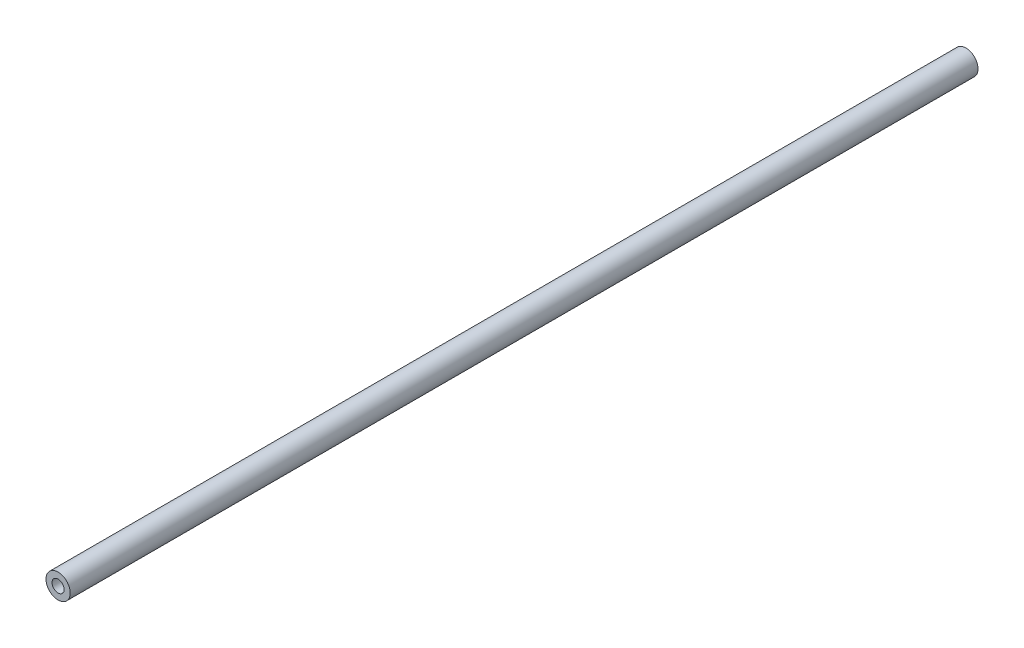
ISO-10303-21;
HEADER;
FILE_DESCRIPTION(('STEP AP214'),'2;1');
FILE_NAME('part.step','',(''),(''),'','','');
FILE_SCHEMA(('AUTOMOTIVE_DESIGN { 1 0 10303 214 1 1 1 1 }'));
ENDSEC;
DATA;
#1=APPLICATION_CONTEXT('core data for automotive mechanical design processes');
#2=APPLICATION_PROTOCOL_DEFINITION('international standard','automotive_design',2000,#1);
#3=PRODUCT_CONTEXT('',#1,'mechanical');
#4=PRODUCT('Part','Part','',(#3));
#5=PRODUCT_RELATED_PRODUCT_CATEGORY('part','',(#4));
#6=PRODUCT_DEFINITION_FORMATION('','',#4);
#7=PRODUCT_DEFINITION_CONTEXT('part definition',#1,'design');
#8=PRODUCT_DEFINITION('design','',#6,#7);
#9=PRODUCT_DEFINITION_SHAPE('','',#8);
#10=(LENGTH_UNIT() NAMED_UNIT(*) SI_UNIT(.MILLI.,.METRE.));
#11=(NAMED_UNIT(*) PLANE_ANGLE_UNIT() SI_UNIT($,.RADIAN.));
#12=(NAMED_UNIT(*) SI_UNIT($,.STERADIAN.) SOLID_ANGLE_UNIT());
#13=UNCERTAINTY_MEASURE_WITH_UNIT(LENGTH_MEASURE(1.E-05),#10,'distance_accuracy_value','');
#14=(GEOMETRIC_REPRESENTATION_CONTEXT(3) GLOBAL_UNCERTAINTY_ASSIGNED_CONTEXT((#13)) GLOBAL_UNIT_ASSIGNED_CONTEXT((#10,
#11,#12)) REPRESENTATION_CONTEXT('',''));
#15=CARTESIAN_POINT('',(0.,0.,0.));
#16=DIRECTION('',(0.,0.,1.));
#17=DIRECTION('',(1.,0.,0.));
#18=AXIS2_PLACEMENT_3D('',#15,#16,#17);
#19=CARTESIAN_POINT('',(0.,0.,0.));
#20=DIRECTION('',(0.,0.,1.));
#21=DIRECTION('',(1.,0.,0.));
#22=AXIS2_PLACEMENT_3D('',#19,#20,#21);
#23=CYLINDRICAL_SURFACE('',#22,1.99999999999999);
#24=CARTESIAN_POINT('',(0.,0.,75.));
#25=DIRECTION('',(0.,0.,1.));
#26=DIRECTION('',(1.,0.,0.));
#27=AXIS2_PLACEMENT_3D('',#24,#25,#26);
#28=CIRCLE('',#27,1.99999999999999);
#29=CARTESIAN_POINT('',(1.99999999999999,0.,75.));
#30=VERTEX_POINT('',#29);
#31=EDGE_CURVE('E10',#30,#30,#28,.T.);
#32=ORIENTED_EDGE('',*,*,#31,.F.);
#33=EDGE_LOOP('',(#32));
#34=FACE_BOUND('',#33,.T.);
#35=CARTESIAN_POINT('',(0.,0.,-75.));
#36=DIRECTION('',(0.,0.,1.));
#37=DIRECTION('',(1.,0.,0.));
#38=AXIS2_PLACEMENT_3D('',#35,#36,#37);
#39=CIRCLE('',#38,1.99999999999999);
#40=CARTESIAN_POINT('',(1.99999999999999,0.,-75.));
#41=VERTEX_POINT('',#40);
#42=EDGE_CURVE('E64',#41,#41,#39,.T.);
#43=ORIENTED_EDGE('',*,*,#42,.T.);
#44=EDGE_LOOP('',(#43));
#45=FACE_BOUND('',#44,.T.);
#46=ADVANCED_FACE('F47',(#34,#45),#23,.T.);
#47=CARTESIAN_POINT('',(-1.99999999999999,0.,75.));
#48=DIRECTION('',(0.,0.,-1.));
#49=DIRECTION('',(-1.,0.,0.));
#50=AXIS2_PLACEMENT_3D('',#47,#48,#49);
#51=PLANE('',#50);
#52=CARTESIAN_POINT('',(0.,0.,75.));
#53=DIRECTION('',(0.,0.,1.));
#54=DIRECTION('',(1.,0.,0.));
#55=AXIS2_PLACEMENT_3D('',#52,#53,#54);
#56=CIRCLE('',#55,0.999999999999991);
#57=CARTESIAN_POINT('',(0.999999999999991,0.,75.));
#58=VERTEX_POINT('',#57);
#59=EDGE_CURVE('E54',#58,#58,#56,.T.);
#60=ORIENTED_EDGE('',*,*,#59,.F.);
#61=EDGE_LOOP('',(#60));
#62=FACE_BOUND('',#61,.T.);
#63=ORIENTED_EDGE('',*,*,#31,.T.);
#64=EDGE_LOOP('',(#63));
#65=FACE_BOUND('',#64,.T.);
#66=ADVANCED_FACE('F80',(#62,#65),#51,.F.);
#67=CARTESIAN_POINT('',(0.,0.,0.));
#68=DIRECTION('',(0.,0.,1.));
#69=DIRECTION('',(1.,0.,0.));
#70=AXIS2_PLACEMENT_3D('',#67,#68,#69);
#71=CYLINDRICAL_SURFACE('',#70,0.999999999999991);
#72=CARTESIAN_POINT('',(0.,0.,-75.));
#73=DIRECTION('',(0.,0.,1.));
#74=DIRECTION('',(1.,0.,0.));
#75=AXIS2_PLACEMENT_3D('',#72,#73,#74);
#76=CIRCLE('',#75,0.999999999999991);
#77=CARTESIAN_POINT('',(0.999999999999991,0.,-75.));
#78=VERTEX_POINT('',#77);
#79=EDGE_CURVE('E59',#78,#78,#76,.T.);
#80=ORIENTED_EDGE('',*,*,#79,.F.);
#81=EDGE_LOOP('',(#80));
#82=FACE_BOUND('',#81,.T.);
#83=ORIENTED_EDGE('',*,*,#59,.T.);
#84=EDGE_LOOP('',(#83));
#85=FACE_BOUND('',#84,.T.);
#86=ADVANCED_FACE('F75',(#82,#85),#71,.F.);
#87=CARTESIAN_POINT('',(-1.99999999999999,0.,-75.));
#88=DIRECTION('',(0.,0.,1.));
#89=DIRECTION('',(1.,0.,0.));
#90=AXIS2_PLACEMENT_3D('',#87,#88,#89);
#91=PLANE('',#90);
#92=ORIENTED_EDGE('',*,*,#42,.F.);
#93=EDGE_LOOP('',(#92));
#94=FACE_BOUND('',#93,.T.);
#95=ORIENTED_EDGE('',*,*,#79,.T.);
#96=EDGE_LOOP('',(#95));
#97=FACE_BOUND('',#96,.T.);
#98=ADVANCED_FACE('F72',(#94,#97),#91,.F.);
#99=CLOSED_SHELL('',(#46,#66,#86,#98));
#100=MANIFOLD_SOLID_BREP('B2',#99);
#101=ADVANCED_BREP_SHAPE_REPRESENTATION('',(#18,#100),#14);
#102=SHAPE_DEFINITION_REPRESENTATION(#9,#101);
ENDSEC;
END-ISO-10303-21;
